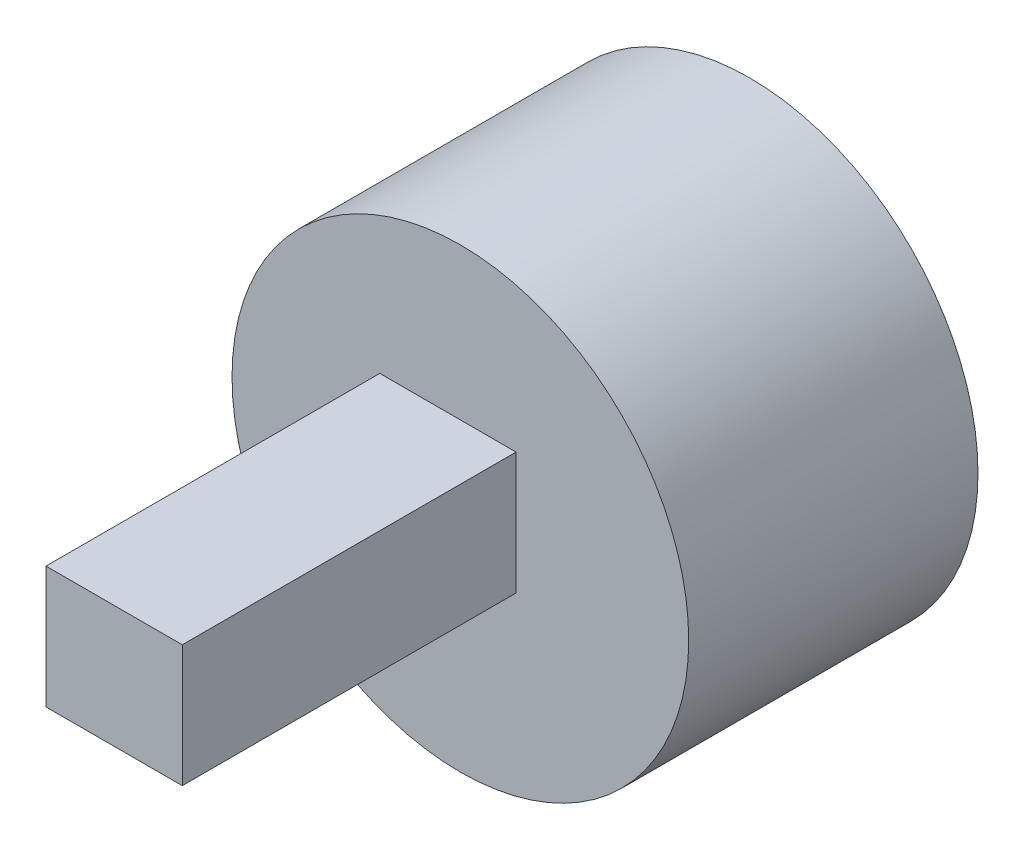
ISO-10303-21;
HEADER;
FILE_DESCRIPTION(('STEP AP214'),'2;1');
FILE_NAME('part.step','',(''),(''),'','','');
FILE_SCHEMA(('AUTOMOTIVE_DESIGN { 1 0 10303 214 1 1 1 1 }'));
ENDSEC;
DATA;
#1=APPLICATION_CONTEXT('core data for automotive mechanical design processes');
#2=APPLICATION_PROTOCOL_DEFINITION('international standard','automotive_design',2000,#1);
#3=PRODUCT_CONTEXT('',#1,'mechanical');
#4=PRODUCT('Part','Part','',(#3));
#5=PRODUCT_RELATED_PRODUCT_CATEGORY('part','',(#4));
#6=PRODUCT_DEFINITION_FORMATION('','',#4);
#7=PRODUCT_DEFINITION_CONTEXT('part definition',#1,'design');
#8=PRODUCT_DEFINITION('design','',#6,#7);
#9=PRODUCT_DEFINITION_SHAPE('','',#8);
#10=(LENGTH_UNIT() NAMED_UNIT(*) SI_UNIT(.MILLI.,.METRE.));
#11=(NAMED_UNIT(*) PLANE_ANGLE_UNIT() SI_UNIT($,.RADIAN.));
#12=(NAMED_UNIT(*) SI_UNIT($,.STERADIAN.) SOLID_ANGLE_UNIT());
#13=UNCERTAINTY_MEASURE_WITH_UNIT(LENGTH_MEASURE(1.E-05),#10,'distance_accuracy_value','');
#14=(GEOMETRIC_REPRESENTATION_CONTEXT(3) GLOBAL_UNCERTAINTY_ASSIGNED_CONTEXT((#13)) GLOBAL_UNIT_ASSIGNED_CONTEXT((#10,
#11,#12)) REPRESENTATION_CONTEXT('',''));
#15=CARTESIAN_POINT('',(0.,0.,0.));
#16=DIRECTION('',(0.,0.,1.));
#17=DIRECTION('',(1.,0.,0.));
#18=AXIS2_PLACEMENT_3D('',#15,#16,#17);
#19=CARTESIAN_POINT('',(0.,0.,26.));
#20=DIRECTION('',(0.,0.,1.));
#21=DIRECTION('',(1.,0.,0.));
#22=AXIS2_PLACEMENT_3D('',#19,#20,#21);
#23=PLANE('',#22);
#24=CARTESIAN_POINT('',(0.,0.,26.));
#25=DIRECTION('',(0.,0.,1.));
#26=DIRECTION('',(1.,0.,0.));
#27=AXIS2_PLACEMENT_3D('',#24,#25,#26);
#28=CIRCLE('',#27,20.5227200432265);
#29=CARTESIAN_POINT('',(20.5227200432265,0.,26.));
#30=VERTEX_POINT('',#29);
#31=EDGE_CURVE('E11',#30,#30,#28,.T.);
#32=ORIENTED_EDGE('',*,*,#31,.T.);
#33=EDGE_LOOP('',(#32));
#34=FACE_BOUND('',#33,.T.);
#35=DIRECTION('',(-1.,0.,0.));
#36=VECTOR('',#35,1.);
#37=CARTESIAN_POINT('',(-7.24376669523963,6.89622002931856,26.));
#38=LINE('',#37,#36);
#39=CARTESIAN_POINT('',(5.00451334067975,6.89622002931856,26.));
#40=VERTEX_POINT('',#39);
#41=CARTESIAN_POINT('',(-7.24376669523963,6.89622002931856,26.));
#42=VERTEX_POINT('',#41);
#43=EDGE_CURVE('E91',#40,#42,#38,.T.);
#44=ORIENTED_EDGE('',*,*,#43,.F.);
#45=DIRECTION('',(0.,1.,0.));
#46=VECTOR('',#45,1.);
#47=CARTESIAN_POINT('',(5.00451334067975,-4.07242684508446,26.));
#48=LINE('',#47,#46);
#49=CARTESIAN_POINT('',(5.00451334067975,-4.07242684508446,26.));
#50=VERTEX_POINT('',#49);
#51=EDGE_CURVE('E102',#50,#40,#48,.T.);
#52=ORIENTED_EDGE('',*,*,#51,.F.);
#53=DIRECTION('',(1.,0.,0.));
#54=VECTOR('',#53,1.);
#55=CARTESIAN_POINT('',(-7.24376669523963,-4.07242684508446,26.));
#56=LINE('',#55,#54);
#57=CARTESIAN_POINT('',(-7.24376669523963,-4.07242684508446,26.));
#58=VERTEX_POINT('',#57);
#59=EDGE_CURVE('E72',#58,#50,#56,.T.);
#60=ORIENTED_EDGE('',*,*,#59,.F.);
#61=DIRECTION('',(0.,-1.,0.));
#62=VECTOR('',#61,1.);
#63=CARTESIAN_POINT('',(-7.24376669523963,-4.07242684508446,26.));
#64=LINE('',#63,#62);
#65=EDGE_CURVE('E106',#42,#58,#64,.T.);
#66=ORIENTED_EDGE('',*,*,#65,.F.);
#67=EDGE_LOOP('',(#44,#52,#60,#66));
#68=FACE_BOUND('',#67,.T.);
#69=ADVANCED_FACE('F35',(#34,#68),#23,.T.);
#70=CARTESIAN_POINT('',(0.,0.,26.));
#71=DIRECTION('',(0.,0.,-1.));
#72=DIRECTION('',(-1.,0.,0.));
#73=AXIS2_PLACEMENT_3D('',#70,#71,#72);
#74=CYLINDRICAL_SURFACE('',#73,20.5227200432265);
#75=ORIENTED_EDGE('',*,*,#31,.F.);
#76=EDGE_LOOP('',(#75));
#77=FACE_BOUND('',#76,.T.);
#78=CARTESIAN_POINT('',(0.,0.,0.));
#79=DIRECTION('',(0.,0.,1.));
#80=DIRECTION('',(1.,0.,0.));
#81=AXIS2_PLACEMENT_3D('',#78,#79,#80);
#82=CIRCLE('',#81,20.5227200432265);
#83=CARTESIAN_POINT('',(20.5227200432265,0.,0.));
#84=VERTEX_POINT('',#83);
#85=EDGE_CURVE('E39',#84,#84,#82,.T.);
#86=ORIENTED_EDGE('',*,*,#85,.T.);
#87=EDGE_LOOP('',(#86));
#88=FACE_BOUND('',#87,.T.);
#89=ADVANCED_FACE('F37',(#77,#88),#74,.T.);
#90=CARTESIAN_POINT('',(0.,0.,0.));
#91=DIRECTION('',(0.,0.,1.));
#92=DIRECTION('',(1.,0.,0.));
#93=AXIS2_PLACEMENT_3D('',#90,#91,#92);
#94=PLANE('',#93);
#95=ORIENTED_EDGE('',*,*,#85,.F.);
#96=EDGE_LOOP('',(#95));
#97=FACE_BOUND('',#96,.T.);
#98=ADVANCED_FACE('F115',(#97),#94,.F.);
#99=CARTESIAN_POINT('',(5.00451334067975,-4.07242684508446,56.));
#100=DIRECTION('',(-1.,0.,0.));
#101=DIRECTION('',(0.,0.,1.));
#102=AXIS2_PLACEMENT_3D('',#99,#100,#101);
#103=PLANE('',#102);
#104=ORIENTED_EDGE('',*,*,#51,.T.);
#105=DIRECTION('',(0.,0.,-1.));
#106=VECTOR('',#105,1.);
#107=CARTESIAN_POINT('',(5.00451334067975,6.89622002931856,56.));
#108=LINE('',#107,#106);
#109=CARTESIAN_POINT('',(5.00451334067975,6.89622002931856,56.));
#110=VERTEX_POINT('',#109);
#111=EDGE_CURVE('E94',#110,#40,#108,.T.);
#112=ORIENTED_EDGE('',*,*,#111,.F.);
#113=DIRECTION('',(0.,1.,0.));
#114=VECTOR('',#113,1.);
#115=CARTESIAN_POINT('',(5.00451334067975,-4.07242684508446,56.));
#116=LINE('',#115,#114);
#117=CARTESIAN_POINT('',(5.00451334067975,-4.07242684508446,56.));
#118=VERTEX_POINT('',#117);
#119=EDGE_CURVE('E84',#118,#110,#116,.T.);
#120=ORIENTED_EDGE('',*,*,#119,.F.);
#121=DIRECTION('',(0.,0.,-1.));
#122=VECTOR('',#121,1.);
#123=CARTESIAN_POINT('',(5.00451334067975,-4.07242684508446,56.));
#124=LINE('',#123,#122);
#125=EDGE_CURVE('E98',#118,#50,#124,.T.);
#126=ORIENTED_EDGE('',*,*,#125,.T.);
#127=EDGE_LOOP('',(#104,#112,#120,#126));
#128=FACE_BOUND('',#127,.T.);
#129=ADVANCED_FACE('F117',(#128),#103,.F.);
#130=CARTESIAN_POINT('',(-7.24376669523963,6.89622002931856,56.));
#131=DIRECTION('',(0.,-1.,0.));
#132=DIRECTION('',(0.,0.,-1.));
#133=AXIS2_PLACEMENT_3D('',#130,#131,#132);
#134=PLANE('',#133);
#135=ORIENTED_EDGE('',*,*,#43,.T.);
#136=DIRECTION('',(0.,0.,-1.));
#137=VECTOR('',#136,1.);
#138=CARTESIAN_POINT('',(-7.24376669523963,6.89622002931856,56.));
#139=LINE('',#138,#137);
#140=CARTESIAN_POINT('',(-7.24376669523963,6.89622002931856,56.));
#141=VERTEX_POINT('',#140);
#142=EDGE_CURVE('E88',#141,#42,#139,.T.);
#143=ORIENTED_EDGE('',*,*,#142,.F.);
#144=DIRECTION('',(-1.,0.,0.));
#145=VECTOR('',#144,1.);
#146=CARTESIAN_POINT('',(-7.24376669523963,6.89622002931856,56.));
#147=LINE('',#146,#145);
#148=EDGE_CURVE('E79',#110,#141,#147,.T.);
#149=ORIENTED_EDGE('',*,*,#148,.F.);
#150=ORIENTED_EDGE('',*,*,#111,.T.);
#151=EDGE_LOOP('',(#135,#143,#149,#150));
#152=FACE_BOUND('',#151,.T.);
#153=ADVANCED_FACE('F89',(#152),#134,.F.);
#154=CARTESIAN_POINT('',(-7.24376669523963,-4.07242684508446,56.));
#155=DIRECTION('',(1.,0.,0.));
#156=DIRECTION('',(0.,0.,-1.));
#157=AXIS2_PLACEMENT_3D('',#154,#155,#156);
#158=PLANE('',#157);
#159=ORIENTED_EDGE('',*,*,#65,.T.);
#160=DIRECTION('',(0.,0.,-1.));
#161=VECTOR('',#160,1.);
#162=CARTESIAN_POINT('',(-7.24376669523963,-4.07242684508446,56.));
#163=LINE('',#162,#161);
#164=CARTESIAN_POINT('',(-7.24376669523963,-4.07242684508446,56.));
#165=VERTEX_POINT('',#164);
#166=EDGE_CURVE('E50',#165,#58,#163,.T.);
#167=ORIENTED_EDGE('',*,*,#166,.F.);
#168=DIRECTION('',(0.,-1.,0.));
#169=VECTOR('',#168,1.);
#170=CARTESIAN_POINT('',(-7.24376669523963,-4.07242684508446,56.));
#171=LINE('',#170,#169);
#172=EDGE_CURVE('E82',#141,#165,#171,.T.);
#173=ORIENTED_EDGE('',*,*,#172,.F.);
#174=ORIENTED_EDGE('',*,*,#142,.T.);
#175=EDGE_LOOP('',(#159,#167,#173,#174));
#176=FACE_BOUND('',#175,.T.);
#177=ADVANCED_FACE('F96',(#176),#158,.F.);
#178=CARTESIAN_POINT('',(-7.24376669523963,-4.07242684508446,56.));
#179=DIRECTION('',(0.,1.,0.));
#180=DIRECTION('',(0.,0.,1.));
#181=AXIS2_PLACEMENT_3D('',#178,#179,#180);
#182=PLANE('',#181);
#183=ORIENTED_EDGE('',*,*,#59,.T.);
#184=ORIENTED_EDGE('',*,*,#125,.F.);
#185=DIRECTION('',(1.,0.,0.));
#186=VECTOR('',#185,1.);
#187=CARTESIAN_POINT('',(-7.24376669523963,-4.07242684508446,56.));
#188=LINE('',#187,#186);
#189=EDGE_CURVE('E58',#165,#118,#188,.T.);
#190=ORIENTED_EDGE('',*,*,#189,.F.);
#191=ORIENTED_EDGE('',*,*,#166,.T.);
#192=EDGE_LOOP('',(#183,#184,#190,#191));
#193=FACE_BOUND('',#192,.T.);
#194=ADVANCED_FACE('F136',(#193),#182,.F.);
#195=CARTESIAN_POINT('',(0.,0.,56.));
#196=DIRECTION('',(0.,0.,-1.));
#197=DIRECTION('',(-1.,0.,0.));
#198=AXIS2_PLACEMENT_3D('',#195,#196,#197);
#199=PLANE('',#198);
#200=ORIENTED_EDGE('',*,*,#119,.T.);
#201=ORIENTED_EDGE('',*,*,#148,.T.);
#202=ORIENTED_EDGE('',*,*,#172,.T.);
#203=ORIENTED_EDGE('',*,*,#189,.T.);
#204=EDGE_LOOP('',(#200,#201,#202,#203));
#205=FACE_BOUND('',#204,.T.);
#206=ADVANCED_FACE('F80',(#205),#199,.F.);
#207=CLOSED_SHELL('',(#69,#89,#98,#129,#153,#177,#194,#206));
#208=MANIFOLD_SOLID_BREP('B2',#207);
#209=ADVANCED_BREP_SHAPE_REPRESENTATION('',(#18,#208),#14);
#210=SHAPE_DEFINITION_REPRESENTATION(#9,#209);
ENDSEC;
END-ISO-10303-21;
